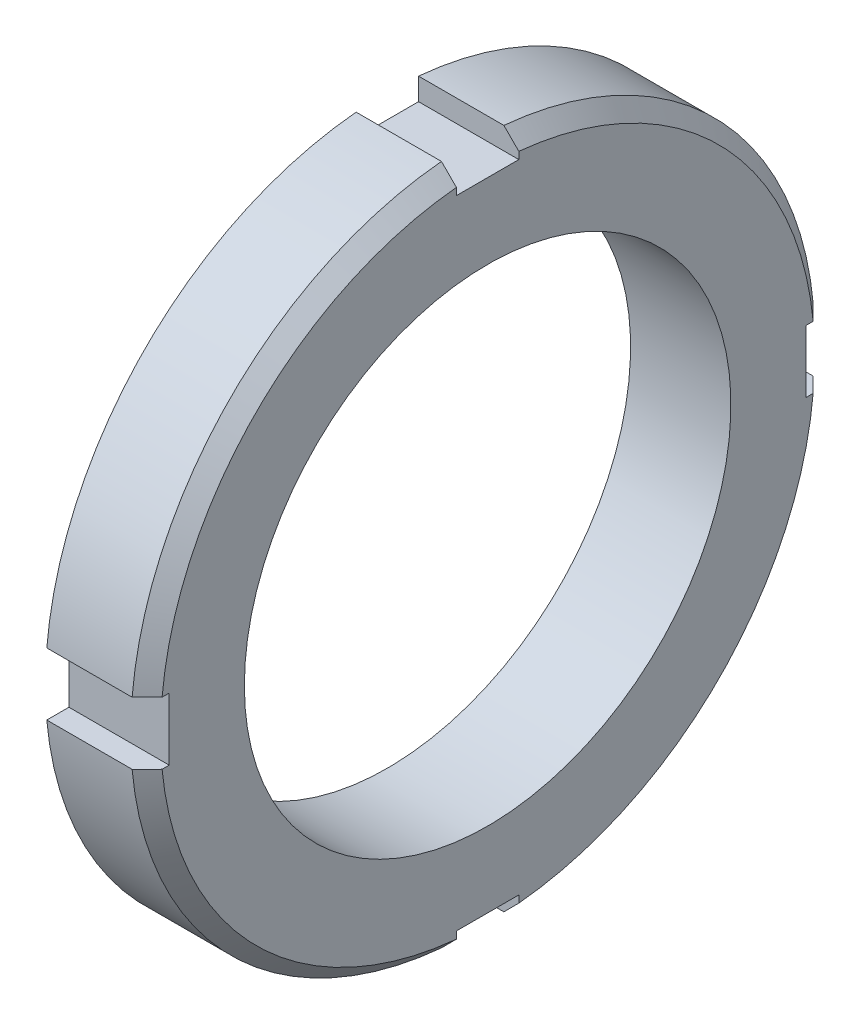
ISO-10303-21;
HEADER;
FILE_DESCRIPTION(('STEP AP214'),'2;1');
FILE_NAME('part.step','',(''),(''),'','','');
FILE_SCHEMA(('AUTOMOTIVE_DESIGN { 1 0 10303 214 1 1 1 1 }'));
ENDSEC;
DATA;
#1=APPLICATION_CONTEXT('core data for automotive mechanical design processes');
#2=APPLICATION_PROTOCOL_DEFINITION('international standard','automotive_design',2000,#1);
#3=PRODUCT_CONTEXT('',#1,'mechanical');
#4=PRODUCT('Part','Part','',(#3));
#5=PRODUCT_RELATED_PRODUCT_CATEGORY('part','',(#4));
#6=PRODUCT_DEFINITION_FORMATION('','',#4);
#7=PRODUCT_DEFINITION_CONTEXT('part definition',#1,'design');
#8=PRODUCT_DEFINITION('design','',#6,#7);
#9=PRODUCT_DEFINITION_SHAPE('','',#8);
#10=(LENGTH_UNIT() NAMED_UNIT(*) SI_UNIT(.MILLI.,.METRE.));
#11=(NAMED_UNIT(*) PLANE_ANGLE_UNIT() SI_UNIT($,.RADIAN.));
#12=(NAMED_UNIT(*) SI_UNIT($,.STERADIAN.) SOLID_ANGLE_UNIT());
#13=UNCERTAINTY_MEASURE_WITH_UNIT(LENGTH_MEASURE(1.E-05),#10,'distance_accuracy_value','');
#14=(GEOMETRIC_REPRESENTATION_CONTEXT(3) GLOBAL_UNCERTAINTY_ASSIGNED_CONTEXT((#13)) GLOBAL_UNIT_ASSIGNED_CONTEXT((#10,
#11,#12)) REPRESENTATION_CONTEXT('',''));
#15=CARTESIAN_POINT('',(0.,0.,0.));
#16=DIRECTION('',(0.,0.,1.));
#17=DIRECTION('',(1.,0.,0.));
#18=AXIS2_PLACEMENT_3D('',#15,#16,#17);
#19=CARTESIAN_POINT('',(10.0776218564,-217.671164606,-140.1008397876));
#20=DIRECTION('',(-1.,0.,0.));
#21=DIRECTION('',(0.,0.,1.));
#22=AXIS2_PLACEMENT_3D('',#19,#20,#21);
#23=CONICAL_SURFACE('',#22,29.9085,0.78539816339745);
#24=CARTESIAN_POINT('',(5.88662185435924,-214.559664605423,-106.143595079126));
#25=CARTESIAN_POINT('',(6.25291031300002,-214.559664605712,-106.511414452663));
#26=CARTESIAN_POINT('',(6.61917127701627,-214.559664605904,-106.879261198204));
#27=CARTESIAN_POINT('',(7.35163821593596,-214.559664606096,-107.61500943343));
#28=CARTESIAN_POINT('',(7.71784419083937,-214.559664606096,-107.982910923115));
#29=CARTESIAN_POINT('',(8.08402267111824,-214.559664606,-108.350839784804));
#30=B_SPLINE_CURVE_WITH_KNOTS('',3,(#24,#25,#26,#27,#28,#29),.UNSPECIFIED.,.F.,.F.,(4,2,4),(0.,
1.55728125195933,3.11456250449792),.UNSPECIFIED.);
#31=CARTESIAN_POINT('',(5.88662185518807,-214.559664604358,-106.143595080875));
#32=VERTEX_POINT('',#31);
#33=CARTESIAN_POINT('',(7.3776218564,-214.559664606,-107.641128759928));
#34=VERTEX_POINT('',#33);
#35=EDGE_CURVE('E202',#32,#34,#30,.T.);
#36=ORIENTED_EDGE('',*,*,#35,.T.);
#37=CARTESIAN_POINT('',(7.3776218564,-217.671164606,-140.1008397876));
#38=DIRECTION('',(-1.,0.,0.));
#39=DIRECTION('',(0.,0.,1.));
#40=AXIS2_PLACEMENT_3D('',#37,#38,#39);
#41=CIRCLE('',#40,32.6085);
#42=CARTESIAN_POINT('',(7.3776218564,-185.211453578328,-136.9893397876));
#43=VERTEX_POINT('',#42);
#44=EDGE_CURVE('E442',#34,#43,#41,.T.);
#45=ORIENTED_EDGE('',*,*,#44,.T.);
#46=CARTESIAN_POINT('',(8.08402267022282,-185.921164604041,-136.989339788913));
#47=CARTESIAN_POINT('',(7.71784419022512,-185.553235741638,-136.989339788256));
#48=CARTESIAN_POINT('',(7.35163821539428,-185.185334251447,-136.989339787819));
#49=CARTESIAN_POINT('',(6.61917127620254,-184.449586015625,-136.989339787381));
#50=CARTESIAN_POINT('',(6.25291031184168,-184.081739269993,-136.989339787381));
#51=CARTESIAN_POINT('',(5.88662185264768,-183.713919896573,-136.9893397876));
#52=B_SPLINE_CURVE_WITH_KNOTS('',3,(#46,#47,#48,#49,#50,#51),.UNSPECIFIED.,.F.,.F.,(4,2,4),(0.,
1.55728125346073,3.11456250634209),.UNSPECIFIED.);
#53=CARTESIAN_POINT('',(5.88662185463681,-183.713919898571,-136.9893397876));
#54=VERTEX_POINT('',#53);
#55=EDGE_CURVE('E289',#43,#54,#52,.T.);
#56=ORIENTED_EDGE('',*,*,#55,.T.);
#57=CARTESIAN_POINT('',(5.8866218564,-217.671164606,-140.1008397876));
#58=DIRECTION('',(1.,0.,0.));
#59=DIRECTION('',(0.,0.,-1.));
#60=AXIS2_PLACEMENT_3D('',#57,#58,#59);
#61=CIRCLE('',#60,34.0995);
#62=EDGE_CURVE('E201',#54,#32,#61,.T.);
#63=ORIENTED_EDGE('',*,*,#62,.T.);
#64=EDGE_LOOP('',(#36,#45,#56,#63));
#65=FACE_BOUND('',#64,.T.);
#66=ADVANCED_FACE('F36',(#65),#23,.T.);
#67=CARTESIAN_POINT('',(5.88662185567538,-183.713919896534,-143.212339789918));
#68=CARTESIAN_POINT('',(6.25291031371122,-184.08173927062,-143.212339788759));
#69=CARTESIAN_POINT('',(6.61917127731532,-184.449586016518,-143.212339787986));
#70=CARTESIAN_POINT('',(7.35163821579629,-185.185334252075,-143.212339787214));
#71=CARTESIAN_POINT('',(7.71784419067313,-185.553235741734,-143.212339787214));
#72=CARTESIAN_POINT('',(8.08402267111821,-185.921164603204,-143.2123397876));
#73=B_SPLINE_CURVE_WITH_KNOTS('',3,(#67,#68,#69,#70,#71,#72),.UNSPECIFIED.,.F.,.F.,(4,2,4),(0.,
1.55728125184623,3.11456250427187),.UNSPECIFIED.);
#74=CARTESIAN_POINT('',(5.88662185526785,-183.713919899674,-143.212339792725));
#75=VERTEX_POINT('',#74);
#76=CARTESIAN_POINT('',(7.3776218564,-185.211453578328,-143.2123397876));
#77=VERTEX_POINT('',#76);
#78=EDGE_CURVE('E196',#75,#77,#73,.T.);
#79=ORIENTED_EDGE('',*,*,#78,.T.);
#80=CARTESIAN_POINT('',(7.3776218564,-214.559664606,-172.560550815272));
#81=VERTEX_POINT('',#80);
#82=EDGE_CURVE('E659',#77,#81,#41,.T.);
#83=ORIENTED_EDGE('',*,*,#82,.T.);
#84=CARTESIAN_POINT('',(8.08402266916641,-214.559664607259,-171.850839790691));
#85=CARTESIAN_POINT('',(7.71784418933293,-214.55966460663,-172.218768652893));
#86=CARTESIAN_POINT('',(7.35163821467223,-214.55966460621,-172.58667014289));
#87=CARTESIAN_POINT('',(6.61917127583263,-214.55966460579,-173.322418378335));
#88=CARTESIAN_POINT('',(6.25291031165375,-214.55966460579,-173.690265123784));
#89=CARTESIAN_POINT('',(5.88662185264767,-214.559664606,-174.058084497027));
#90=B_SPLINE_CURVE_WITH_KNOTS('',3,(#84,#85,#86,#87,#88,#89),.UNSPECIFIED.,.F.,.F.,(4,2,4),(0.,
1.55728125268685,3.11456250479438),.UNSPECIFIED.);
#91=CARTESIAN_POINT('',(5.88662185463683,-214.559664606,-174.058084495029));
#92=VERTEX_POINT('',#91);
#93=EDGE_CURVE('E176',#81,#92,#90,.T.);
#94=ORIENTED_EDGE('',*,*,#93,.T.);
#95=CARTESIAN_POINT('',(5.8866218564,-217.671164606,-140.1008397876));
#96=DIRECTION('',(1.,0.,0.));
#97=DIRECTION('',(0.,0.,-1.));
#98=AXIS2_PLACEMENT_3D('',#95,#96,#97);
#99=CIRCLE('',#98,34.0995);
#100=EDGE_CURVE('E179',#92,#75,#99,.T.);
#101=ORIENTED_EDGE('',*,*,#100,.T.);
#102=EDGE_LOOP('',(#79,#83,#94,#101));
#103=FACE_BOUND('',#102,.T.);
#104=ADVANCED_FACE('F449',(#103),#23,.T.);
#105=CARTESIAN_POINT('',(5.88662185365707,-220.782664606,-174.058084496013));
#106=CARTESIAN_POINT('',(6.25291031217854,-220.782664606,-173.690265122979));
#107=CARTESIAN_POINT('',(6.61917127601168,-220.782664606,-173.322418377878));
#108=CARTESIAN_POINT('',(7.35163821443751,-220.782664606,-172.586670143403));
#109=CARTESIAN_POINT('',(7.71784418903019,-220.782664606,-172.218768654031));
#110=CARTESIAN_POINT('',(8.08402266893451,-220.782664606,-171.85083979259));
#111=B_SPLINE_CURVE_WITH_KNOTS('',3,(#105,#106,#107,#108,#109,#110),.UNSPECIFIED.,.F.,.F.,(4,2,
4),(0.,1.5572812506376,3.11456250185442),.UNSPECIFIED.);
#112=CARTESIAN_POINT('',(5.88662185502853,-220.782664600678,-174.058084495124));
#113=VERTEX_POINT('',#112);
#114=CARTESIAN_POINT('',(7.3776218564,-220.782664606,-172.560550815272));
#115=VERTEX_POINT('',#114);
#116=EDGE_CURVE('E161',#113,#115,#111,.T.);
#117=ORIENTED_EDGE('',*,*,#116,.T.);
#118=CARTESIAN_POINT('',(7.3776218564,-250.130875633673,-143.2123397876));
#119=VERTEX_POINT('',#118);
#120=EDGE_CURVE('E54',#115,#119,#41,.T.);
#121=ORIENTED_EDGE('',*,*,#120,.T.);
#122=CARTESIAN_POINT('',(8.08402266916641,-249.421164609091,-143.212339786341));
#123=CARTESIAN_POINT('',(7.71784418955756,-249.789093471068,-143.21233978697));
#124=CARTESIAN_POINT('',(7.35163821512152,-250.156994960839,-143.21233978739));
#125=CARTESIAN_POINT('',(6.61917127673131,-250.892743195833,-143.21233978781));
#126=CARTESIAN_POINT('',(6.25291031277716,-251.260589941056,-143.21233978781));
#127=CARTESIAN_POINT('',(5.88662185399584,-251.628409314073,-143.2123397876));
#128=B_SPLINE_CURVE_WITH_KNOTS('',3,(#122,#123,#124,#125,#126,#127),.UNSPECIFIED.,.F.,.F.,(4,2,
4),(0.,1.55728125173158,3.11456250288381),.UNSPECIFIED.);
#129=CARTESIAN_POINT('',(5.88662185519801,-251.628409312676,-143.212339789676));
#130=VERTEX_POINT('',#129);
#131=EDGE_CURVE('E124',#119,#130,#128,.T.);
#132=ORIENTED_EDGE('',*,*,#131,.T.);
#133=CARTESIAN_POINT('',(5.8866218564,-217.671164606,-140.1008397876));
#134=DIRECTION('',(1.,0.,0.));
#135=DIRECTION('',(0.,0.,-1.));
#136=AXIS2_PLACEMENT_3D('',#133,#134,#135);
#137=CIRCLE('',#136,34.0995);
#138=EDGE_CURVE('E128',#130,#113,#137,.T.);
#139=ORIENTED_EDGE('',*,*,#138,.T.);
#140=EDGE_LOOP('',(#117,#121,#132,#139));
#141=FACE_BOUND('',#140,.T.);
#142=ADVANCED_FACE('F127',(#141),#23,.T.);
#143=CARTESIAN_POINT('',(5.8866218538166,-251.628409314253,-136.9893397876));
#144=CARTESIAN_POINT('',(6.25291031231146,-251.260589941246,-136.9893397876));
#145=CARTESIAN_POINT('',(6.61917127611799,-250.892743196171,-136.9893397876));
#146=CARTESIAN_POINT('',(7.35163821449064,-250.15699496175,-136.9893397876));
#147=CARTESIAN_POINT('',(7.71784418905673,-249.789093472404,-136.9893397876));
#148=CARTESIAN_POINT('',(8.08402266893448,-249.42116461099,-136.9893397876));
#149=B_SPLINE_CURVE_WITH_KNOTS('',3,(#143,#144,#145,#146,#147,#148),.UNSPECIFIED.,.F.,.F.,(4,2,
4),(0.,1.55728125052456,3.11456250162831),.UNSPECIFIED.);
#150=CARTESIAN_POINT('',(5.8866218551083,-251.628409313125,-136.98933978944));
#151=VERTEX_POINT('',#150);
#152=CARTESIAN_POINT('',(7.3776218564,-250.130875633673,-136.9893397876));
#153=VERTEX_POINT('',#152);
#154=EDGE_CURVE('E229',#151,#153,#149,.T.);
#155=ORIENTED_EDGE('',*,*,#154,.T.);
#156=CARTESIAN_POINT('',(7.3776218564,-220.782664606,-107.641128759928));
#157=VERTEX_POINT('',#156);
#158=EDGE_CURVE('E439',#153,#157,#41,.T.);
#159=ORIENTED_EDGE('',*,*,#158,.T.);
#160=CARTESIAN_POINT('',(8.08402267182778,-220.782664605463,-108.350839786227));
#161=CARTESIAN_POINT('',(7.71784419139163,-220.782664605732,-107.982910923897));
#162=CARTESIAN_POINT('',(7.35163821620781,-220.782664605911,-107.615009433693));
#163=CARTESIAN_POINT('',(6.61917127648109,-220.78266460609,-106.879261197675));
#164=CARTESIAN_POINT('',(6.25291031193821,-220.78266460609,-106.511414451861));
#165=CARTESIAN_POINT('',(5.88662185264768,-220.782664606,-106.143595078173));
#166=B_SPLINE_CURVE_WITH_KNOTS('',3,(#160,#161,#162,#163,#164,#165),.UNSPECIFIED.,.F.,.F.,(4,2,
4),(0.,1.5572812542346,3.11456250788994),.UNSPECIFIED.);
#167=CARTESIAN_POINT('',(5.88662185463683,-220.782664606,-106.143595080171));
#168=VERTEX_POINT('',#167);
#169=EDGE_CURVE('E219',#157,#168,#166,.T.);
#170=ORIENTED_EDGE('',*,*,#169,.T.);
#171=CARTESIAN_POINT('',(5.8866218564,-217.671164606,-140.1008397876));
#172=DIRECTION('',(1.,0.,0.));
#173=DIRECTION('',(0.,0.,-1.));
#174=AXIS2_PLACEMENT_3D('',#171,#172,#173);
#175=CIRCLE('',#174,34.0995);
#176=EDGE_CURVE('E223',#168,#151,#175,.T.);
#177=ORIENTED_EDGE('',*,*,#176,.T.);
#178=EDGE_LOOP('',(#155,#159,#170,#177));
#179=FACE_BOUND('',#178,.T.);
#180=ADVANCED_FACE('F256',(#179),#23,.T.);
#181=CARTESIAN_POINT('',(8.148261072,-251.6284093152,-143.2123397876));
#182=DIRECTION('',(0.,0.,-1.));
#183=DIRECTION('',(-1.,0.,0.));
#184=AXIS2_PLACEMENT_3D('',#181,#182,#183);
#185=PLANE('',#184);
#186=ORIENTED_EDGE('',*,*,#131,.F.);
#187=DIRECTION('',(0.,1.,0.));
#188=VECTOR('',#187,1.);
#189=CARTESIAN_POINT('',(7.3776218564,-251.6284093152,-143.2123397876));
#190=LINE('',#189,#188);
#191=CARTESIAN_POINT('',(7.3776218564,-249.421164606,-143.2123397876));
#192=VERTEX_POINT('',#191);
#193=EDGE_CURVE('E438',#119,#192,#190,.T.);
#194=ORIENTED_EDGE('',*,*,#193,.T.);
#195=DIRECTION('',(-1.,0.,0.));
#196=VECTOR('',#195,1.);
#197=CARTESIAN_POINT('',(2.8628690266,-249.421164606,-143.2123397876));
#198=LINE('',#197,#196);
#199=CARTESIAN_POINT('',(-2.6223781436,-249.421164590776,-143.212339786935));
#200=VERTEX_POINT('',#199);
#201=EDGE_CURVE('E40',#192,#200,#198,.T.);
#202=ORIENTED_EDGE('',*,*,#201,.T.);
#203=DIRECTION('',(0.,1.,0.));
#204=VECTOR('',#203,1.);
#205=CARTESIAN_POINT('',(-2.6223781436,-217.671164606,-143.212339786603));
#206=LINE('',#205,#204);
#207=CARTESIAN_POINT('',(-2.6223781436,-251.628409311514,-143.212339789177));
#208=VERTEX_POINT('',#207);
#209=EDGE_CURVE('E147',#208,#200,#206,.T.);
#210=ORIENTED_EDGE('',*,*,#209,.F.);
#211=DIRECTION('',(-1.,0.,0.));
#212=VECTOR('',#211,1.);
#213=CARTESIAN_POINT('',(1.6321218564,-251.628409311279,-143.212339791751));
#214=LINE('',#213,#212);
#215=EDGE_CURVE('E139',#208,#130,#214,.F.);
#216=ORIENTED_EDGE('',*,*,#215,.T.);
#217=EDGE_LOOP('',(#186,#194,#202,#210,#216));
#218=FACE_BOUND('',#217,.T.);
#219=ADVANCED_FACE('F144',(#218),#185,.F.);
#220=CARTESIAN_POINT('',(-2.6223781436,-249.421164606,-143.2123397876));
#221=DIRECTION('',(0.,1.,0.));
#222=DIRECTION('',(0.,0.,1.));
#223=AXIS2_PLACEMENT_3D('',#220,#221,#222);
#224=PLANE('',#223);
#225=ORIENTED_EDGE('',*,*,#201,.F.);
#226=DIRECTION('',(0.,0.,1.));
#227=VECTOR('',#226,1.);
#228=CARTESIAN_POINT('',(7.3776218564,-249.421164606,-143.2123397876));
#229=LINE('',#228,#227);
#230=CARTESIAN_POINT('',(7.3776218564,-249.421164606,-136.9893397876));
#231=VERTEX_POINT('',#230);
#232=EDGE_CURVE('E436',#192,#231,#229,.T.);
#233=ORIENTED_EDGE('',*,*,#232,.T.);
#234=DIRECTION('',(-1.,0.,0.));
#235=VECTOR('',#234,1.);
#236=CARTESIAN_POINT('',(2.7629414642,-249.421164606,-136.9893397876));
#237=LINE('',#236,#235);
#238=CARTESIAN_POINT('',(-2.6223781436,-249.421164590776,-136.989339805198));
#239=VERTEX_POINT('',#238);
#240=EDGE_CURVE('E227',#231,#239,#237,.T.);
#241=ORIENTED_EDGE('',*,*,#240,.T.);
#242=DIRECTION('',(0.,0.,1.));
#243=VECTOR('',#242,1.);
#244=CARTESIAN_POINT('',(-2.6223781436,-249.421164583164,-140.1008398003));
#245=LINE('',#244,#243);
#246=EDGE_CURVE('E149',#200,#239,#245,.T.);
#247=ORIENTED_EDGE('',*,*,#246,.F.);
#248=EDGE_LOOP('',(#225,#233,#241,#247));
#249=FACE_BOUND('',#248,.T.);
#250=ADVANCED_FACE('F264',(#249),#224,.F.);
#251=CARTESIAN_POINT('',(-2.6223781436,-251.6284093152,-136.9893397876));
#252=DIRECTION('',(0.,0.,1.));
#253=DIRECTION('',(1.,0.,0.));
#254=AXIS2_PLACEMENT_3D('',#251,#252,#253);
#255=PLANE('',#254);
#256=ORIENTED_EDGE('',*,*,#240,.F.);
#257=DIRECTION('',(0.,-1.,0.));
#258=VECTOR('',#257,1.);
#259=CARTESIAN_POINT('',(7.3776218564,-251.6284093152,-136.9893397876));
#260=LINE('',#259,#258);
#261=EDGE_CURVE('E133',#231,#153,#260,.T.);
#262=ORIENTED_EDGE('',*,*,#261,.T.);
#263=ORIENTED_EDGE('',*,*,#154,.F.);
#264=DIRECTION('',(1.,0.,0.));
#265=VECTOR('',#264,1.);
#266=CARTESIAN_POINT('',(1.6321218564,-251.628409311996,-136.98933979128));
#267=LINE('',#266,#265);
#268=CARTESIAN_POINT('',(-2.6223781436,-251.628409313037,-136.989339802639));
#269=VERTEX_POINT('',#268);
#270=EDGE_CURVE('E220',#151,#269,#267,.F.);
#271=ORIENTED_EDGE('',*,*,#270,.T.);
#272=DIRECTION('',(0.,-1.,0.));
#273=VECTOR('',#272,1.);
#274=CARTESIAN_POINT('',(-2.6223781436,-217.671164606,-136.989339813997));
#275=LINE('',#274,#273);
#276=EDGE_CURVE('E329',#239,#269,#275,.T.);
#277=ORIENTED_EDGE('',*,*,#276,.F.);
#278=EDGE_LOOP('',(#256,#262,#263,#271,#277));
#279=FACE_BOUND('',#278,.T.);
#280=ADVANCED_FACE('F259',(#279),#255,.F.);
#281=CARTESIAN_POINT('',(-2.6223781436,-217.671164606,-140.1008397876));
#282=DIRECTION('',(1.,0.,0.));
#283=DIRECTION('',(0.,0.,-1.));
#284=AXIS2_PLACEMENT_3D('',#281,#282,#283);
#285=CYLINDRICAL_SURFACE('',#284,34.0995);
#286=ORIENTED_EDGE('',*,*,#176,.F.);
#287=DIRECTION('',(-1.,0.,0.));
#288=VECTOR('',#287,1.);
#289=CARTESIAN_POINT('',(2.7629414642,-220.782664606,-106.1435950784));
#290=LINE('',#289,#288);
#291=CARTESIAN_POINT('',(-2.6223781436,-220.782664599726,-106.143595079596));
#292=VERTEX_POINT('',#291);
#293=EDGE_CURVE('E216',#168,#292,#290,.T.);
#294=ORIENTED_EDGE('',*,*,#293,.T.);
#295=CARTESIAN_POINT('',(-2.6223781436,-217.671164606,-140.1008397876));
#296=DIRECTION('',(1.,0.,0.));
#297=DIRECTION('',(0.,0.,-1.));
#298=AXIS2_PLACEMENT_3D('',#295,#296,#297);
#299=CIRCLE('',#298,34.0995);
#300=EDGE_CURVE('E327',#269,#292,#299,.F.);
#301=ORIENTED_EDGE('',*,*,#300,.F.);
#302=ORIENTED_EDGE('',*,*,#270,.F.);
#303=EDGE_LOOP('',(#286,#294,#301,#302));
#304=FACE_BOUND('',#303,.T.);
#305=ADVANCED_FACE('F263',(#304),#285,.T.);
#306=CARTESIAN_POINT('',(-2.6223781436,-220.782664606,-106.1435950784));
#307=DIRECTION('',(0.,-1.,0.));
#308=DIRECTION('',(0.,0.,-1.));
#309=AXIS2_PLACEMENT_3D('',#306,#307,#308);
#310=PLANE('',#309);
#311=ORIENTED_EDGE('',*,*,#169,.F.);
#312=DIRECTION('',(0.,0.,-1.));
#313=VECTOR('',#312,1.);
#314=CARTESIAN_POINT('',(7.3776218564,-220.782664606,-106.1435950784));
#315=LINE('',#314,#313);
#316=CARTESIAN_POINT('',(7.3776218564,-220.782664606,-108.3508397876));
#317=VERTEX_POINT('',#316);
#318=EDGE_CURVE('E440',#157,#317,#315,.T.);
#319=ORIENTED_EDGE('',*,*,#318,.T.);
#320=DIRECTION('',(-1.,0.,0.));
#321=VECTOR('',#320,1.);
#322=CARTESIAN_POINT('',(2.8628690266,-220.782664606,-108.3508397876));
#323=LINE('',#322,#321);
#324=CARTESIAN_POINT('',(-2.6223781436,-220.782664597635,-108.350839819113));
#325=VERTEX_POINT('',#324);
#326=EDGE_CURVE('E203',#317,#325,#323,.T.);
#327=ORIENTED_EDGE('',*,*,#326,.T.);
#328=DIRECTION('',(0.,0.,-1.));
#329=VECTOR('',#328,1.);
#330=CARTESIAN_POINT('',(-2.6223781436,-220.782664593453,-140.1008398003));
#331=LINE('',#330,#329);
#332=EDGE_CURVE('E212',#292,#325,#331,.T.);
#333=ORIENTED_EDGE('',*,*,#332,.F.);
#334=ORIENTED_EDGE('',*,*,#293,.F.);
#335=EDGE_LOOP('',(#311,#319,#327,#333,#334));
#336=FACE_BOUND('',#335,.T.);
#337=ADVANCED_FACE('F266',(#336),#310,.F.);
#338=CARTESIAN_POINT('',(8.3481161968,-220.782664606,-108.3508397876));
#339=DIRECTION('',(0.,0.,-1.));
#340=DIRECTION('',(-1.,0.,0.));
#341=AXIS2_PLACEMENT_3D('',#338,#339,#340);
#342=PLANE('',#341);
#343=ORIENTED_EDGE('',*,*,#326,.F.);
#344=DIRECTION('',(0.,1.,0.));
#345=VECTOR('',#344,1.);
#346=CARTESIAN_POINT('',(7.3776218564,-220.782664606,-108.3508397876));
#347=LINE('',#346,#345);
#348=CARTESIAN_POINT('',(7.3776218564,-214.559664606,-108.3508397876));
#349=VERTEX_POINT('',#348);
#350=EDGE_CURVE('E399',#317,#349,#347,.T.);
#351=ORIENTED_EDGE('',*,*,#350,.T.);
#352=DIRECTION('',(-1.,0.,0.));
#353=VECTOR('',#352,1.);
#354=CARTESIAN_POINT('',(2.7629414642,-214.559664606,-108.3508397876));
#355=LINE('',#354,#353);
#356=CARTESIAN_POINT('',(-2.6223781436,-214.559664614365,-108.350839819113));
#357=VERTEX_POINT('',#356);
#358=EDGE_CURVE('E197',#349,#357,#355,.T.);
#359=ORIENTED_EDGE('',*,*,#358,.T.);
#360=DIRECTION('',(0.,1.,0.));
#361=VECTOR('',#360,1.);
#362=CARTESIAN_POINT('',(-2.6223781436,-217.671164606,-108.350839834869));
#363=LINE('',#362,#361);
#364=EDGE_CURVE('E208',#325,#357,#363,.T.);
#365=ORIENTED_EDGE('',*,*,#364,.F.);
#366=EDGE_LOOP('',(#343,#351,#359,#365));
#367=FACE_BOUND('',#366,.T.);
#368=ADVANCED_FACE('F270',(#367),#342,.F.);
#369=CARTESIAN_POINT('',(-2.6223781436,-214.559664606,-108.3508397876));
#370=DIRECTION('',(0.,1.,0.));
#371=DIRECTION('',(0.,0.,1.));
#372=AXIS2_PLACEMENT_3D('',#369,#370,#371);
#373=PLANE('',#372);
#374=ORIENTED_EDGE('',*,*,#358,.F.);
#375=DIRECTION('',(0.,0.,1.));
#376=VECTOR('',#375,1.);
#377=CARTESIAN_POINT('',(7.3776218564,-214.559664606,-108.3508397876));
#378=LINE('',#377,#376);
#379=EDGE_CURVE('E404',#349,#34,#378,.T.);
#380=ORIENTED_EDGE('',*,*,#379,.T.);
#381=ORIENTED_EDGE('',*,*,#35,.F.);
#382=DIRECTION('',(1.,0.,0.));
#383=VECTOR('',#382,1.);
#384=CARTESIAN_POINT('',(1.6321218564,-214.559664602715,-106.143595082242));
#385=LINE('',#384,#383);
#386=CARTESIAN_POINT('',(-2.6223781436,-214.559664610631,-106.143595081517));
#387=VERTEX_POINT('',#386);
#388=EDGE_CURVE('E207',#32,#387,#385,.F.);
#389=ORIENTED_EDGE('',*,*,#388,.T.);
#390=DIRECTION('',(0.,0.,1.));
#391=VECTOR('',#390,1.);
#392=CARTESIAN_POINT('',(-2.6223781436,-214.559664618547,-140.1008398003));
#393=LINE('',#392,#391);
#394=EDGE_CURVE('E211',#357,#387,#393,.T.);
#395=ORIENTED_EDGE('',*,*,#394,.F.);
#396=EDGE_LOOP('',(#374,#380,#381,#389,#395));
#397=FACE_BOUND('',#396,.T.);
#398=ADVANCED_FACE('F274',(#397),#373,.F.);
#399=CARTESIAN_POINT('',(-2.6223781436,-217.671164606,-140.1008397876));
#400=DIRECTION('',(1.,0.,0.));
#401=DIRECTION('',(0.,0.,-1.));
#402=AXIS2_PLACEMENT_3D('',#399,#400,#401);
#403=CYLINDRICAL_SURFACE('',#402,34.0995);
#404=CARTESIAN_POINT('',(-2.6223781436,-217.671164606,-140.1008397876));
#405=DIRECTION('',(1.,0.,0.));
#406=DIRECTION('',(0.,0.,-1.));
#407=AXIS2_PLACEMENT_3D('',#404,#405,#406);
#408=CIRCLE('',#407,34.0995);
#409=CARTESIAN_POINT('',(-2.6223781436,-183.713919897361,-136.989339800799));
#410=VERTEX_POINT('',#409);
#411=EDGE_CURVE('E330',#387,#410,#408,.F.);
#412=ORIENTED_EDGE('',*,*,#411,.F.);
#413=ORIENTED_EDGE('',*,*,#388,.F.);
#414=ORIENTED_EDGE('',*,*,#62,.F.);
#415=DIRECTION('',(-1.,0.,0.));
#416=VECTOR('',#415,1.);
#417=CARTESIAN_POINT('',(2.7629414642,-183.7139198968,-136.9893397876));
#418=LINE('',#417,#416);
#419=EDGE_CURVE('E191',#54,#410,#418,.T.);
#420=ORIENTED_EDGE('',*,*,#419,.T.);
#421=EDGE_LOOP('',(#412,#413,#414,#420));
#422=FACE_BOUND('',#421,.T.);
#423=ADVANCED_FACE('F279',(#422),#403,.T.);
#424=CARTESIAN_POINT('',(-2.6223781436,-185.921164606,-136.9893397876));
#425=DIRECTION('',(0.,0.,1.));
#426=DIRECTION('',(1.,0.,0.));
#427=AXIS2_PLACEMENT_3D('',#424,#425,#426);
#428=PLANE('',#427);
#429=ORIENTED_EDGE('',*,*,#55,.F.);
#430=DIRECTION('',(0.,-1.,0.));
#431=VECTOR('',#430,1.);
#432=CARTESIAN_POINT('',(7.3776218564,-185.921164606,-136.9893397876));
#433=LINE('',#432,#431);
#434=CARTESIAN_POINT('',(7.3776218564,-185.921164606,-136.9893397876));
#435=VERTEX_POINT('',#434);
#436=EDGE_CURVE('E427',#43,#435,#433,.T.);
#437=ORIENTED_EDGE('',*,*,#436,.T.);
#438=DIRECTION('',(-1.,0.,0.));
#439=VECTOR('',#438,1.);
#440=CARTESIAN_POINT('',(2.8628690266,-185.921164606,-136.9893397876));
#441=LINE('',#440,#439);
#442=CARTESIAN_POINT('',(-2.6223781436,-185.921164621224,-136.989339805198));
#443=VERTEX_POINT('',#442);
#444=EDGE_CURVE('E193',#435,#443,#441,.T.);
#445=ORIENTED_EDGE('',*,*,#444,.T.);
#446=DIRECTION('',(0.,-1.,0.));
#447=VECTOR('',#446,1.);
#448=CARTESIAN_POINT('',(-2.6223781436,-217.671164606,-136.989339813997));
#449=LINE('',#448,#447);
#450=EDGE_CURVE('E186',#410,#443,#449,.T.);
#451=ORIENTED_EDGE('',*,*,#450,.F.);
#452=ORIENTED_EDGE('',*,*,#419,.F.);
#453=EDGE_LOOP('',(#429,#437,#445,#451,#452));
#454=FACE_BOUND('',#453,.T.);
#455=ADVANCED_FACE('F281',(#454),#428,.F.);
#456=CARTESIAN_POINT('',(-2.6223781436,-185.921164606,-136.9893397876));
#457=DIRECTION('',(0.,-1.,0.));
#458=DIRECTION('',(0.,0.,-1.));
#459=AXIS2_PLACEMENT_3D('',#456,#457,#458);
#460=PLANE('',#459);
#461=ORIENTED_EDGE('',*,*,#444,.F.);
#462=DIRECTION('',(0.,0.,-1.));
#463=VECTOR('',#462,1.);
#464=CARTESIAN_POINT('',(7.3776218564,-185.921164606,-136.9893397876));
#465=LINE('',#464,#463);
#466=CARTESIAN_POINT('',(7.3776218564,-185.921164606,-143.2123397876));
#467=VERTEX_POINT('',#466);
#468=EDGE_CURVE('E351',#435,#467,#465,.T.);
#469=ORIENTED_EDGE('',*,*,#468,.T.);
#470=DIRECTION('',(-1.,0.,0.));
#471=VECTOR('',#470,1.);
#472=CARTESIAN_POINT('',(2.7629414642,-185.921164606,-143.2123397876));
#473=LINE('',#472,#471);
#474=CARTESIAN_POINT('',(-2.6223781436,-185.921164621224,-143.212339786935));
#475=VERTEX_POINT('',#474);
#476=EDGE_CURVE('E168',#467,#475,#473,.T.);
#477=ORIENTED_EDGE('',*,*,#476,.T.);
#478=DIRECTION('',(0.,0.,-1.));
#479=VECTOR('',#478,1.);
#480=CARTESIAN_POINT('',(-2.6223781436,-185.921164628836,-140.1008398003));
#481=LINE('',#480,#479);
#482=EDGE_CURVE('E182',#443,#475,#481,.T.);
#483=ORIENTED_EDGE('',*,*,#482,.F.);
#484=EDGE_LOOP('',(#461,#469,#477,#483));
#485=FACE_BOUND('',#484,.T.);
#486=ADVANCED_FACE('F309',(#485),#460,.F.);
#487=CARTESIAN_POINT('',(8.148261072,-185.921164606,-143.2123397876));
#488=DIRECTION('',(0.,0.,-1.));
#489=DIRECTION('',(-1.,0.,0.));
#490=AXIS2_PLACEMENT_3D('',#487,#488,#489);
#491=PLANE('',#490);
#492=ORIENTED_EDGE('',*,*,#476,.F.);
#493=DIRECTION('',(0.,1.,0.));
#494=VECTOR('',#493,1.);
#495=CARTESIAN_POINT('',(7.3776218564,-185.921164606,-143.2123397876));
#496=LINE('',#495,#494);
#497=EDGE_CURVE('E664',#467,#77,#496,.T.);
#498=ORIENTED_EDGE('',*,*,#497,.T.);
#499=ORIENTED_EDGE('',*,*,#78,.F.);
#500=DIRECTION('',(1.,0.,0.));
#501=VECTOR('',#500,1.);
#502=CARTESIAN_POINT('',(1.6321218564,-183.71391990128,-143.212339797849));
#503=LINE('',#502,#501);
#504=CARTESIAN_POINT('',(-2.6223781436,-183.713919900765,-143.212339792226));
#505=VERTEX_POINT('',#504);
#506=EDGE_CURVE('E177',#75,#505,#503,.F.);
#507=ORIENTED_EDGE('',*,*,#506,.T.);
#508=DIRECTION('',(0.,1.,0.));
#509=VECTOR('',#508,1.);
#510=CARTESIAN_POINT('',(-2.6223781436,-217.671164606,-143.212339786603));
#511=LINE('',#510,#509);
#512=EDGE_CURVE('E185',#475,#505,#511,.T.);
#513=ORIENTED_EDGE('',*,*,#512,.F.);
#514=EDGE_LOOP('',(#492,#498,#499,#507,#513));
#515=FACE_BOUND('',#514,.T.);
#516=ADVANCED_FACE('F305',(#515),#491,.F.);
#517=CARTESIAN_POINT('',(-2.6223781436,-217.671164606,-140.1008397876));
#518=DIRECTION('',(1.,0.,0.));
#519=DIRECTION('',(0.,0.,-1.));
#520=AXIS2_PLACEMENT_3D('',#517,#518,#519);
#521=CYLINDRICAL_SURFACE('',#520,34.0995);
#522=ORIENTED_EDGE('',*,*,#100,.F.);
#523=DIRECTION('',(-1.,0.,0.));
#524=VECTOR('',#523,1.);
#525=CARTESIAN_POINT('',(2.7629414642,-214.559664606,-174.0580844968));
#526=LINE('',#525,#524);
#527=CARTESIAN_POINT('',(-2.6223781436,-214.559664612274,-174.058084495604));
#528=VERTEX_POINT('',#527);
#529=EDGE_CURVE('E167',#92,#528,#526,.T.);
#530=ORIENTED_EDGE('',*,*,#529,.T.);
#531=CARTESIAN_POINT('',(-2.6223781436,-217.671164606,-140.1008397876));
#532=DIRECTION('',(1.,0.,0.));
#533=DIRECTION('',(0.,0.,-1.));
#534=AXIS2_PLACEMENT_3D('',#531,#532,#533);
#535=CIRCLE('',#534,34.0995);
#536=EDGE_CURVE('E332',#505,#528,#535,.F.);
#537=ORIENTED_EDGE('',*,*,#536,.F.);
#538=ORIENTED_EDGE('',*,*,#506,.F.);
#539=EDGE_LOOP('',(#522,#530,#537,#538));
#540=FACE_BOUND('',#539,.T.);
#541=ADVANCED_FACE('F308',(#540),#521,.T.);
#542=CARTESIAN_POINT('',(-2.6223781436,-214.559664606,-174.0580844968));
#543=DIRECTION('',(0.,1.,0.));
#544=DIRECTION('',(0.,0.,1.));
#545=AXIS2_PLACEMENT_3D('',#542,#543,#544);
#546=PLANE('',#545);
#547=ORIENTED_EDGE('',*,*,#93,.F.);
#548=DIRECTION('',(0.,0.,1.));
#549=VECTOR('',#548,1.);
#550=CARTESIAN_POINT('',(7.3776218564,-214.559664606,-174.0580844968));
#551=LINE('',#550,#549);
#552=CARTESIAN_POINT('',(7.3776218564,-214.559664606,-171.8508397876));
#553=VERTEX_POINT('',#552);
#554=EDGE_CURVE('E667',#81,#553,#551,.T.);
#555=ORIENTED_EDGE('',*,*,#554,.T.);
#556=DIRECTION('',(-1.,0.,0.));
#557=VECTOR('',#556,1.);
#558=CARTESIAN_POINT('',(2.8628690266,-214.559664606,-171.8508397876));
#559=LINE('',#558,#557);
#560=CARTESIAN_POINT('',(-2.6223781436,-214.559664614365,-171.85083977302));
#561=VERTEX_POINT('',#560);
#562=EDGE_CURVE('E163',#553,#561,#559,.T.);
#563=ORIENTED_EDGE('',*,*,#562,.T.);
#564=DIRECTION('',(0.,0.,1.));
#565=VECTOR('',#564,1.);
#566=CARTESIAN_POINT('',(-2.6223781436,-214.559664618547,-140.1008398003));
#567=LINE('',#566,#565);
#568=EDGE_CURVE('E334',#528,#561,#567,.T.);
#569=ORIENTED_EDGE('',*,*,#568,.F.);
#570=ORIENTED_EDGE('',*,*,#529,.F.);
#571=EDGE_LOOP('',(#547,#555,#563,#569,#570));
#572=FACE_BOUND('',#571,.T.);
#573=ADVANCED_FACE('F311',(#572),#546,.F.);
#574=CARTESIAN_POINT('',(-2.6223781436,-220.782664606,-171.8508397876));
#575=DIRECTION('',(0.,0.,1.));
#576=DIRECTION('',(1.,0.,0.));
#577=AXIS2_PLACEMENT_3D('',#574,#575,#576);
#578=PLANE('',#577);
#579=ORIENTED_EDGE('',*,*,#562,.F.);
#580=DIRECTION('',(0.,-1.,0.));
#581=VECTOR('',#580,1.);
#582=CARTESIAN_POINT('',(7.3776218564,-220.782664606,-171.8508397876));
#583=LINE('',#582,#581);
#584=CARTESIAN_POINT('',(7.3776218564,-220.782664606,-171.8508397876));
#585=VERTEX_POINT('',#584);
#586=EDGE_CURVE('E669',#553,#585,#583,.T.);
#587=ORIENTED_EDGE('',*,*,#586,.T.);
#588=DIRECTION('',(-1.,0.,0.));
#589=VECTOR('',#588,1.);
#590=CARTESIAN_POINT('',(2.7629414642,-220.782664606,-171.8508397876));
#591=LINE('',#590,#589);
#592=CARTESIAN_POINT('',(-2.6223781436,-220.782664597635,-171.85083977302));
#593=VERTEX_POINT('',#592);
#594=EDGE_CURVE('E141',#585,#593,#591,.T.);
#595=ORIENTED_EDGE('',*,*,#594,.T.);
#596=DIRECTION('',(0.,-1.,0.));
#597=VECTOR('',#596,1.);
#598=CARTESIAN_POINT('',(-2.6223781436,-217.671164606,-171.850839765731));
#599=LINE('',#598,#597);
#600=EDGE_CURVE('E156',#561,#593,#599,.T.);
#601=ORIENTED_EDGE('',*,*,#600,.F.);
#602=EDGE_LOOP('',(#579,#587,#595,#601));
#603=FACE_BOUND('',#602,.T.);
#604=ADVANCED_FACE('F315',(#603),#578,.F.);
#605=CARTESIAN_POINT('',(-2.6223781436,-220.782664606,-171.8508397876));
#606=DIRECTION('',(0.,-1.,0.));
#607=DIRECTION('',(0.,0.,-1.));
#608=AXIS2_PLACEMENT_3D('',#605,#606,#607);
#609=PLANE('',#608);
#610=ORIENTED_EDGE('',*,*,#594,.F.);
#611=DIRECTION('',(0.,0.,-1.));
#612=VECTOR('',#611,1.);
#613=CARTESIAN_POINT('',(7.3776218564,-220.782664606,-171.8508397876));
#614=LINE('',#613,#612);
#615=EDGE_CURVE('E675',#585,#115,#614,.T.);
#616=ORIENTED_EDGE('',*,*,#615,.T.);
#617=ORIENTED_EDGE('',*,*,#116,.F.);
#618=DIRECTION('',(1.,0.,0.));
#619=VECTOR('',#618,1.);
#620=CARTESIAN_POINT('',(1.6321218564,-220.782664595355,-174.058084494234));
#621=LINE('',#620,#619);
#622=CARTESIAN_POINT('',(-2.6223781436,-220.782664594404,-174.058084494321));
#623=VERTEX_POINT('',#622);
#624=EDGE_CURVE('E140',#113,#623,#621,.F.);
#625=ORIENTED_EDGE('',*,*,#624,.T.);
#626=DIRECTION('',(0.,0.,-1.));
#627=VECTOR('',#626,1.);
#628=CARTESIAN_POINT('',(-2.6223781436,-220.782664593453,-140.1008398003));
#629=LINE('',#628,#627);
#630=EDGE_CURVE('E63',#593,#623,#629,.T.);
#631=ORIENTED_EDGE('',*,*,#630,.F.);
#632=EDGE_LOOP('',(#610,#616,#617,#625,#631));
#633=FACE_BOUND('',#632,.T.);
#634=ADVANCED_FACE('F318',(#633),#609,.F.);
#635=CARTESIAN_POINT('',(-2.6223781436,-217.671164606,-140.1008397876));
#636=DIRECTION('',(1.,0.,0.));
#637=DIRECTION('',(0.,0.,-1.));
#638=AXIS2_PLACEMENT_3D('',#635,#636,#637);
#639=CYLINDRICAL_SURFACE('',#638,34.0995);
#640=CARTESIAN_POINT('',(-2.6223781436,-217.671164606,-140.1008397876));
#641=DIRECTION('',(1.,0.,0.));
#642=DIRECTION('',(0.,0.,-1.));
#643=AXIS2_PLACEMENT_3D('',#640,#641,#642);
#644=CIRCLE('',#643,34.0995);
#645=EDGE_CURVE('E46',#623,#208,#644,.F.);
#646=ORIENTED_EDGE('',*,*,#645,.F.);
#647=ORIENTED_EDGE('',*,*,#624,.F.);
#648=ORIENTED_EDGE('',*,*,#138,.F.);
#649=ORIENTED_EDGE('',*,*,#215,.F.);
#650=EDGE_LOOP('',(#646,#647,#648,#649));
#651=FACE_BOUND('',#650,.T.);
#652=ADVANCED_FACE('F138',(#651),#639,.T.);
#653=CARTESIAN_POINT('',(-2.6223781436,-252.0358962574,-174.465571439));
#654=DIRECTION('',(-1.,0.,0.));
#655=DIRECTION('',(0.,0.,1.));
#656=AXIS2_PLACEMENT_3D('',#653,#654,#655);
#657=PLANE('',#656);
#658=CARTESIAN_POINT('',(-2.6223781436,-217.671164606,-140.1008397876));
#659=DIRECTION('',(-1.,0.,0.));
#660=DIRECTION('',(0.,0.,1.));
#661=AXIS2_PLACEMENT_3D('',#658,#659,#660);
#662=CIRCLE('',#661,24.257);
#663=CARTESIAN_POINT('',(-2.6223781436,-217.671164606,-115.8438397876));
#664=VERTEX_POINT('',#663);
#665=EDGE_CURVE('E11',#664,#664,#662,.T.);
#666=ORIENTED_EDGE('',*,*,#665,.F.);
#667=EDGE_LOOP('',(#666));
#668=FACE_BOUND('',#667,.T.);
#669=ORIENTED_EDGE('',*,*,#630,.T.);
#670=ORIENTED_EDGE('',*,*,#645,.T.);
#671=ORIENTED_EDGE('',*,*,#209,.T.);
#672=ORIENTED_EDGE('',*,*,#246,.T.);
#673=ORIENTED_EDGE('',*,*,#276,.T.);
#674=ORIENTED_EDGE('',*,*,#300,.T.);
#675=ORIENTED_EDGE('',*,*,#332,.T.);
#676=ORIENTED_EDGE('',*,*,#364,.T.);
#677=ORIENTED_EDGE('',*,*,#394,.T.);
#678=ORIENTED_EDGE('',*,*,#411,.T.);
#679=ORIENTED_EDGE('',*,*,#450,.T.);
#680=ORIENTED_EDGE('',*,*,#482,.T.);
#681=ORIENTED_EDGE('',*,*,#512,.T.);
#682=ORIENTED_EDGE('',*,*,#536,.T.);
#683=ORIENTED_EDGE('',*,*,#568,.T.);
#684=ORIENTED_EDGE('',*,*,#600,.T.);
#685=EDGE_LOOP('',(#669,#670,#671,#672,#673,#674,#675,#676,#677,#678,#679,#680,#681,#682,#683,#684));
#686=FACE_BOUND('',#685,.T.);
#687=ADVANCED_FACE('F38',(#668,#686),#657,.T.);
#688=CARTESIAN_POINT('',(10.0776218564,-217.671164606,-140.1008397876));
#689=DIRECTION('',(-1.,0.,0.));
#690=DIRECTION('',(0.,0.,1.));
#691=AXIS2_PLACEMENT_3D('',#688,#689,#690);
#692=CYLINDRICAL_SURFACE('',#691,24.257);
#693=CARTESIAN_POINT('',(7.3776218564,-217.671164606,-140.1008397876));
#694=DIRECTION('',(-1.,0.,0.));
#695=DIRECTION('',(0.,0.,1.));
#696=AXIS2_PLACEMENT_3D('',#693,#694,#695);
#697=CIRCLE('',#696,24.257);
#698=CARTESIAN_POINT('',(7.3776218564,-217.671164606,-115.8438397876));
#699=VERTEX_POINT('',#698);
#700=EDGE_CURVE('E162',#699,#699,#697,.T.);
#701=ORIENTED_EDGE('',*,*,#700,.F.);
#702=EDGE_LOOP('',(#701));
#703=FACE_BOUND('',#702,.T.);
#704=ORIENTED_EDGE('',*,*,#665,.T.);
#705=EDGE_LOOP('',(#704));
#706=FACE_BOUND('',#705,.T.);
#707=ADVANCED_FACE('F458',(#703,#706),#692,.F.);
#708=CARTESIAN_POINT('',(7.3776218564,-217.671164606,-140.1008397876));
#709=DIRECTION('',(-1.,0.,0.));
#710=DIRECTION('',(0.,0.,1.));
#711=AXIS2_PLACEMENT_3D('',#708,#709,#710);
#712=PLANE('',#711);
#713=ORIENTED_EDGE('',*,*,#700,.T.);
#714=EDGE_LOOP('',(#713));
#715=FACE_BOUND('',#714,.T.);
#716=ORIENTED_EDGE('',*,*,#232,.F.);
#717=ORIENTED_EDGE('',*,*,#193,.F.);
#718=ORIENTED_EDGE('',*,*,#120,.F.);
#719=ORIENTED_EDGE('',*,*,#615,.F.);
#720=ORIENTED_EDGE('',*,*,#586,.F.);
#721=ORIENTED_EDGE('',*,*,#554,.F.);
#722=ORIENTED_EDGE('',*,*,#82,.F.);
#723=ORIENTED_EDGE('',*,*,#497,.F.);
#724=ORIENTED_EDGE('',*,*,#468,.F.);
#725=ORIENTED_EDGE('',*,*,#436,.F.);
#726=ORIENTED_EDGE('',*,*,#44,.F.);
#727=ORIENTED_EDGE('',*,*,#379,.F.);
#728=ORIENTED_EDGE('',*,*,#350,.F.);
#729=ORIENTED_EDGE('',*,*,#318,.F.);
#730=ORIENTED_EDGE('',*,*,#158,.F.);
#731=ORIENTED_EDGE('',*,*,#261,.F.);
#732=EDGE_LOOP('',(#716,#717,#718,#719,#720,#721,#722,#723,#724,#725,#726,#727,#728,#729,#730,#731));
#733=FACE_BOUND('',#732,.T.);
#734=ADVANCED_FACE('F437',(#715,#733),#712,.F.);
#735=CLOSED_SHELL('',(#66,#104,#142,#180,#219,#250,#280,#305,#337,#368,#398,#423,#455,#486,#516,
#541,#573,#604,#634,#652,#687,#707,#734));
#736=MANIFOLD_SOLID_BREP('B2',#735);
#737=ADVANCED_BREP_SHAPE_REPRESENTATION('',(#18,#736),#14);
#738=SHAPE_DEFINITION_REPRESENTATION(#9,#737);
ENDSEC;
END-ISO-10303-21;
